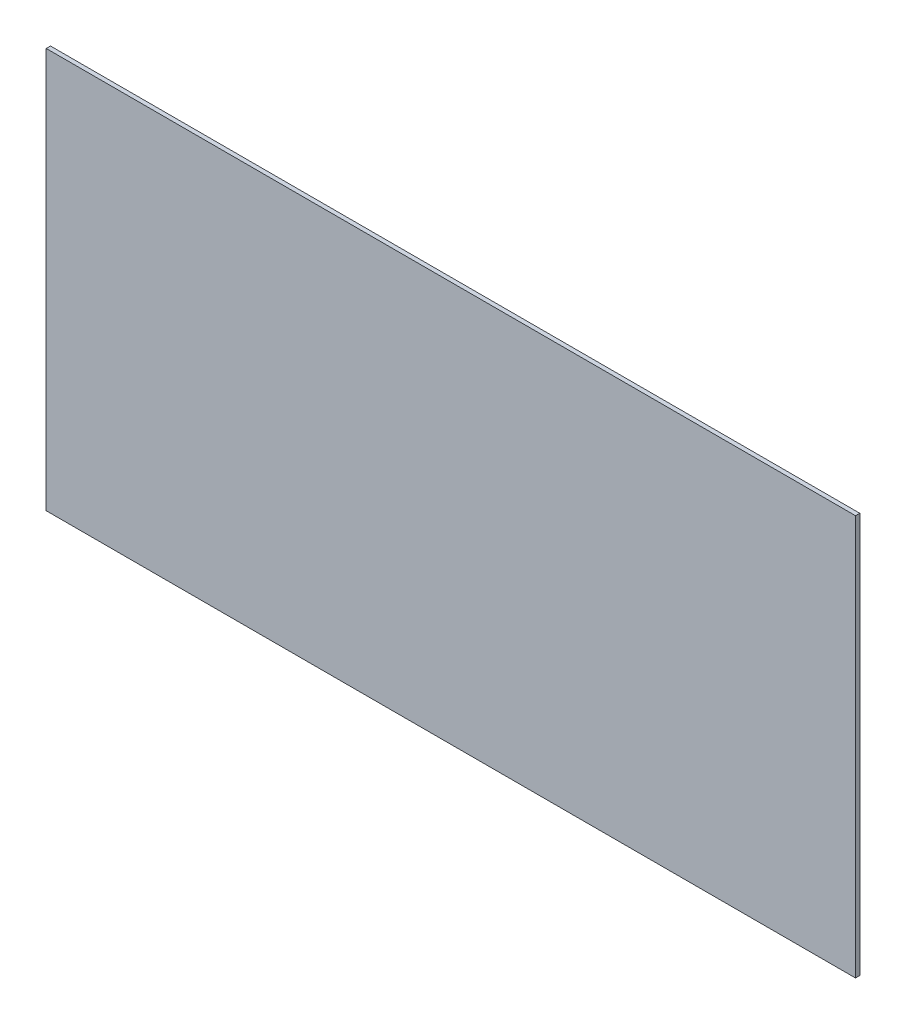
ISO-10303-21;
HEADER;
FILE_DESCRIPTION(('STEP AP214'),'2;1');
FILE_NAME('part.step','',(''),(''),'','','');
FILE_SCHEMA(('AUTOMOTIVE_DESIGN { 1 0 10303 214 1 1 1 1 }'));
ENDSEC;
DATA;
#1=APPLICATION_CONTEXT('core data for automotive mechanical design processes');
#2=APPLICATION_PROTOCOL_DEFINITION('international standard','automotive_design',2000,#1);
#3=PRODUCT_CONTEXT('',#1,'mechanical');
#4=PRODUCT('Part','Part','',(#3));
#5=PRODUCT_RELATED_PRODUCT_CATEGORY('part','',(#4));
#6=PRODUCT_DEFINITION_FORMATION('','',#4);
#7=PRODUCT_DEFINITION_CONTEXT('part definition',#1,'design');
#8=PRODUCT_DEFINITION('design','',#6,#7);
#9=PRODUCT_DEFINITION_SHAPE('','',#8);
#10=(LENGTH_UNIT() NAMED_UNIT(*) SI_UNIT(.MILLI.,.METRE.));
#11=(NAMED_UNIT(*) PLANE_ANGLE_UNIT() SI_UNIT($,.RADIAN.));
#12=(NAMED_UNIT(*) SI_UNIT($,.STERADIAN.) SOLID_ANGLE_UNIT());
#13=UNCERTAINTY_MEASURE_WITH_UNIT(LENGTH_MEASURE(1.E-05),#10,'distance_accuracy_value','');
#14=(GEOMETRIC_REPRESENTATION_CONTEXT(3) GLOBAL_UNCERTAINTY_ASSIGNED_CONTEXT((#13)) GLOBAL_UNIT_ASSIGNED_CONTEXT((#10,
#11,#12)) REPRESENTATION_CONTEXT('',''));
#15=CARTESIAN_POINT('',(0.,0.,0.));
#16=DIRECTION('',(0.,0.,1.));
#17=DIRECTION('',(1.,0.,0.));
#18=AXIS2_PLACEMENT_3D('',#15,#16,#17);
#19=CARTESIAN_POINT('',(603.25,298.45,3.175));
#20=DIRECTION('',(-1.,0.,0.));
#21=DIRECTION('',(0.,-1.,0.));
#22=AXIS2_PLACEMENT_3D('',#19,#20,#21);
#23=PLANE('',#22);
#24=DIRECTION('',(0.,1.,0.));
#25=VECTOR('',#24,1.);
#26=CARTESIAN_POINT('',(603.25,298.45,0.));
#27=LINE('',#26,#25);
#28=CARTESIAN_POINT('',(603.25,0.,0.));
#29=VERTEX_POINT('',#28);
#30=CARTESIAN_POINT('',(603.25,298.45,0.));
#31=VERTEX_POINT('',#30);
#32=EDGE_CURVE('E99',#29,#31,#27,.T.);
#33=ORIENTED_EDGE('',*,*,#32,.T.);
#34=DIRECTION('',(0.,0.,-1.));
#35=VECTOR('',#34,1.);
#36=CARTESIAN_POINT('',(603.25,298.45,3.175));
#37=LINE('',#36,#35);
#38=CARTESIAN_POINT('',(603.25,298.45,3.175));
#39=VERTEX_POINT('',#38);
#40=EDGE_CURVE('E11',#39,#31,#37,.T.);
#41=ORIENTED_EDGE('',*,*,#40,.F.);
#42=DIRECTION('',(0.,1.,0.));
#43=VECTOR('',#42,1.);
#44=CARTESIAN_POINT('',(603.25,298.45,3.175));
#45=LINE('',#44,#43);
#46=CARTESIAN_POINT('',(603.25,0.,3.175));
#47=VERTEX_POINT('',#46);
#48=EDGE_CURVE('E87',#47,#39,#45,.T.);
#49=ORIENTED_EDGE('',*,*,#48,.F.);
#50=DIRECTION('',(0.,0.,-1.));
#51=VECTOR('',#50,1.);
#52=CARTESIAN_POINT('',(603.25,0.,3.175));
#53=LINE('',#52,#51);
#54=EDGE_CURVE('E95',#47,#29,#53,.T.);
#55=ORIENTED_EDGE('',*,*,#54,.T.);
#56=EDGE_LOOP('',(#33,#41,#49,#55));
#57=FACE_BOUND('',#56,.T.);
#58=ADVANCED_FACE('F36',(#57),#23,.F.);
#59=CARTESIAN_POINT('',(603.25,298.45,3.175));
#60=DIRECTION('',(0.,-1.,0.));
#61=DIRECTION('',(1.,0.,0.));
#62=AXIS2_PLACEMENT_3D('',#59,#60,#61);
#63=PLANE('',#62);
#64=DIRECTION('',(-1.,0.,0.));
#65=VECTOR('',#64,1.);
#66=CARTESIAN_POINT('',(603.25,298.45,0.));
#67=LINE('',#66,#65);
#68=CARTESIAN_POINT('',(0.,298.45,0.));
#69=VERTEX_POINT('',#68);
#70=EDGE_CURVE('E91',#31,#69,#67,.T.);
#71=ORIENTED_EDGE('',*,*,#70,.T.);
#72=DIRECTION('',(0.,0.,-1.));
#73=VECTOR('',#72,1.);
#74=CARTESIAN_POINT('',(0.,298.45,3.175));
#75=LINE('',#74,#73);
#76=CARTESIAN_POINT('',(0.,298.45,3.175));
#77=VERTEX_POINT('',#76);
#78=EDGE_CURVE('E44',#77,#69,#75,.T.);
#79=ORIENTED_EDGE('',*,*,#78,.F.);
#80=DIRECTION('',(-1.,0.,0.));
#81=VECTOR('',#80,1.);
#82=CARTESIAN_POINT('',(603.25,298.45,3.175));
#83=LINE('',#82,#81);
#84=EDGE_CURVE('E82',#39,#77,#83,.T.);
#85=ORIENTED_EDGE('',*,*,#84,.F.);
#86=ORIENTED_EDGE('',*,*,#40,.T.);
#87=EDGE_LOOP('',(#71,#79,#85,#86));
#88=FACE_BOUND('',#87,.T.);
#89=ADVANCED_FACE('F90',(#88),#63,.F.);
#90=CARTESIAN_POINT('',(0.,298.45,3.175));
#91=DIRECTION('',(1.,0.,0.));
#92=DIRECTION('',(0.,1.,0.));
#93=AXIS2_PLACEMENT_3D('',#90,#91,#92);
#94=PLANE('',#93);
#95=DIRECTION('',(0.,-1.,0.));
#96=VECTOR('',#95,1.);
#97=CARTESIAN_POINT('',(0.,298.45,0.));
#98=LINE('',#97,#96);
#99=CARTESIAN_POINT('',(0.,0.,0.));
#100=VERTEX_POINT('',#99);
#101=EDGE_CURVE('E69',#69,#100,#98,.T.);
#102=ORIENTED_EDGE('',*,*,#101,.T.);
#103=DIRECTION('',(0.,0.,-1.));
#104=VECTOR('',#103,1.);
#105=CARTESIAN_POINT('',(0.,0.,3.175));
#106=LINE('',#105,#104);
#107=CARTESIAN_POINT('',(0.,0.,3.175));
#108=VERTEX_POINT('',#107);
#109=EDGE_CURVE('E92',#108,#100,#106,.T.);
#110=ORIENTED_EDGE('',*,*,#109,.F.);
#111=DIRECTION('',(0.,-1.,0.));
#112=VECTOR('',#111,1.);
#113=CARTESIAN_POINT('',(0.,298.45,3.175));
#114=LINE('',#113,#112);
#115=EDGE_CURVE('E85',#77,#108,#114,.T.);
#116=ORIENTED_EDGE('',*,*,#115,.F.);
#117=ORIENTED_EDGE('',*,*,#78,.T.);
#118=EDGE_LOOP('',(#102,#110,#116,#117));
#119=FACE_BOUND('',#118,.T.);
#120=ADVANCED_FACE('F93',(#119),#94,.F.);
#121=CARTESIAN_POINT('',(603.25,0.,3.175));
#122=DIRECTION('',(0.,1.,0.));
#123=DIRECTION('',(-1.,0.,0.));
#124=AXIS2_PLACEMENT_3D('',#121,#122,#123);
#125=PLANE('',#124);
#126=DIRECTION('',(1.,0.,0.));
#127=VECTOR('',#126,1.);
#128=CARTESIAN_POINT('',(603.25,0.,0.));
#129=LINE('',#128,#127);
#130=EDGE_CURVE('E75',#100,#29,#129,.T.);
#131=ORIENTED_EDGE('',*,*,#130,.T.);
#132=ORIENTED_EDGE('',*,*,#54,.F.);
#133=DIRECTION('',(1.,0.,0.));
#134=VECTOR('',#133,1.);
#135=CARTESIAN_POINT('',(603.25,0.,3.175));
#136=LINE('',#135,#134);
#137=EDGE_CURVE('E52',#108,#47,#136,.T.);
#138=ORIENTED_EDGE('',*,*,#137,.F.);
#139=ORIENTED_EDGE('',*,*,#109,.T.);
#140=EDGE_LOOP('',(#131,#132,#138,#139));
#141=FACE_BOUND('',#140,.T.);
#142=ADVANCED_FACE('F106',(#141),#125,.F.);
#143=CARTESIAN_POINT('',(0.,0.,3.175));
#144=DIRECTION('',(0.,0.,-1.));
#145=DIRECTION('',(-1.,0.,0.));
#146=AXIS2_PLACEMENT_3D('',#143,#144,#145);
#147=PLANE('',#146);
#148=ORIENTED_EDGE('',*,*,#48,.T.);
#149=ORIENTED_EDGE('',*,*,#84,.T.);
#150=ORIENTED_EDGE('',*,*,#115,.T.);
#151=ORIENTED_EDGE('',*,*,#137,.T.);
#152=EDGE_LOOP('',(#148,#149,#150,#151));
#153=FACE_BOUND('',#152,.T.);
#154=ADVANCED_FACE('F83',(#153),#147,.F.);
#155=CARTESIAN_POINT('',(0.,0.,0.));
#156=DIRECTION('',(0.,0.,-1.));
#157=DIRECTION('',(-1.,0.,0.));
#158=AXIS2_PLACEMENT_3D('',#155,#156,#157);
#159=PLANE('',#158);
#160=ORIENTED_EDGE('',*,*,#32,.F.);
#161=ORIENTED_EDGE('',*,*,#130,.F.);
#162=ORIENTED_EDGE('',*,*,#101,.F.);
#163=ORIENTED_EDGE('',*,*,#70,.F.);
#164=EDGE_LOOP('',(#160,#161,#162,#163));
#165=FACE_BOUND('',#164,.T.);
#166=ADVANCED_FACE('F109',(#165),#159,.T.);
#167=CLOSED_SHELL('',(#58,#89,#120,#142,#154,#166));
#168=MANIFOLD_SOLID_BREP('B2',#167);
#169=ADVANCED_BREP_SHAPE_REPRESENTATION('',(#18,#168),#14);
#170=SHAPE_DEFINITION_REPRESENTATION(#9,#169);
ENDSEC;
END-ISO-10303-21;
